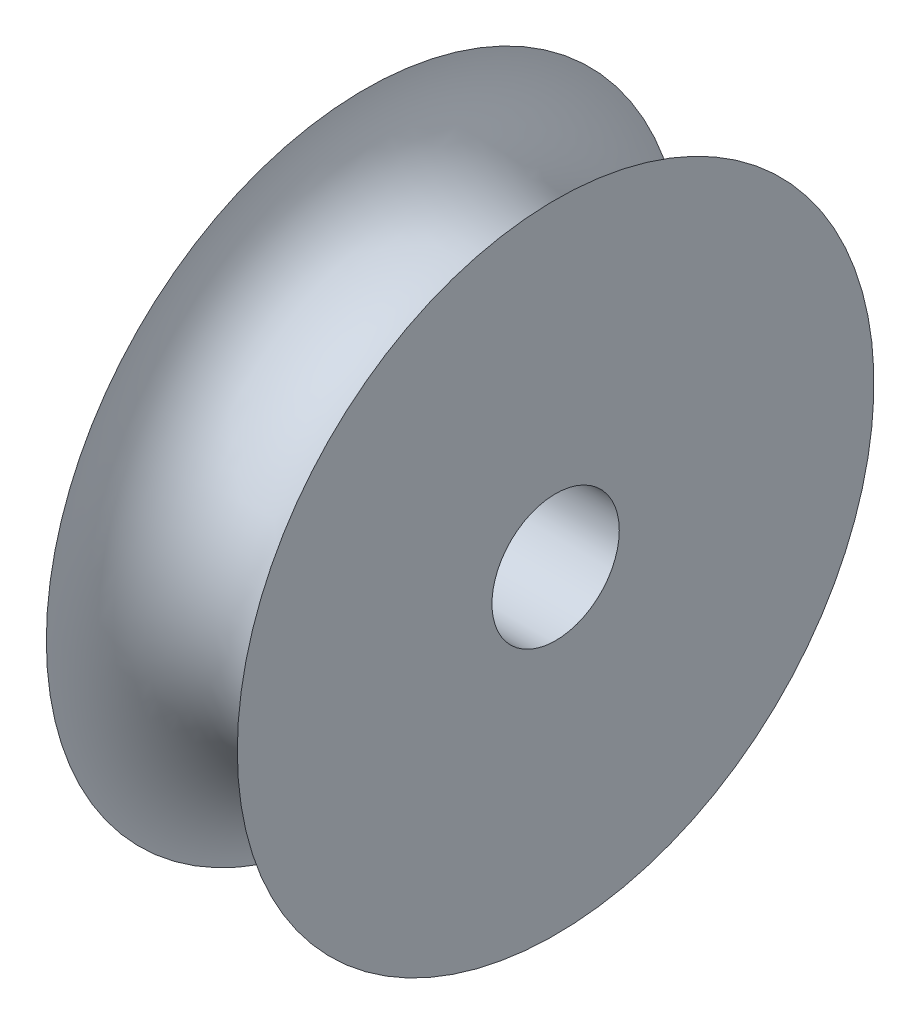
ISO-10303-21;
HEADER;
FILE_DESCRIPTION(('STEP AP214'),'2;1');
FILE_NAME('part.step','',(''),(''),'','','');
FILE_SCHEMA(('AUTOMOTIVE_DESIGN { 1 0 10303 214 1 1 1 1 }'));
ENDSEC;
DATA;
#1=APPLICATION_CONTEXT('core data for automotive mechanical design processes');
#2=APPLICATION_PROTOCOL_DEFINITION('international standard','automotive_design',2000,#1);
#3=PRODUCT_CONTEXT('',#1,'mechanical');
#4=PRODUCT('Part','Part','',(#3));
#5=PRODUCT_RELATED_PRODUCT_CATEGORY('part','',(#4));
#6=PRODUCT_DEFINITION_FORMATION('','',#4);
#7=PRODUCT_DEFINITION_CONTEXT('part definition',#1,'design');
#8=PRODUCT_DEFINITION('design','',#6,#7);
#9=PRODUCT_DEFINITION_SHAPE('','',#8);
#10=(LENGTH_UNIT() NAMED_UNIT(*) SI_UNIT(.MILLI.,.METRE.));
#11=(NAMED_UNIT(*) PLANE_ANGLE_UNIT() SI_UNIT($,.RADIAN.));
#12=(NAMED_UNIT(*) SI_UNIT($,.STERADIAN.) SOLID_ANGLE_UNIT());
#13=UNCERTAINTY_MEASURE_WITH_UNIT(LENGTH_MEASURE(1.E-05),#10,'distance_accuracy_value','');
#14=(GEOMETRIC_REPRESENTATION_CONTEXT(3) GLOBAL_UNCERTAINTY_ASSIGNED_CONTEXT((#13)) GLOBAL_UNIT_ASSIGNED_CONTEXT((#10,
#11,#12)) REPRESENTATION_CONTEXT('',''));
#15=CARTESIAN_POINT('',(0.,0.,0.));
#16=DIRECTION('',(0.,0.,1.));
#17=DIRECTION('',(1.,0.,0.));
#18=AXIS2_PLACEMENT_3D('',#15,#16,#17);
#19=CARTESIAN_POINT('',(4.7625,0.,0.));
#20=DIRECTION('',(-1.,0.,0.));
#21=DIRECTION('',(0.,0.,1.));
#22=AXIS2_PLACEMENT_3D('',#19,#20,#21);
#23=TOROIDAL_SURFACE('',#22,15.875,4.7625);
#24=CARTESIAN_POINT('',(0.,0.,0.));
#25=DIRECTION('',(-1.,0.,0.));
#26=DIRECTION('',(0.,0.,1.));
#27=AXIS2_PLACEMENT_3D('',#24,#25,#26);
#28=CIRCLE('',#27,15.875);
#29=CARTESIAN_POINT('',(0.,0.,15.875));
#30=VERTEX_POINT('',#29);
#31=EDGE_CURVE('E10',#30,#30,#28,.T.);
#32=ORIENTED_EDGE('',*,*,#31,.F.);
#33=EDGE_LOOP('',(#32));
#34=FACE_BOUND('',#33,.T.);
#35=CARTESIAN_POINT('',(9.525,0.,0.));
#36=DIRECTION('',(-1.,0.,0.));
#37=DIRECTION('',(0.,0.,1.));
#38=AXIS2_PLACEMENT_3D('',#35,#36,#37);
#39=CIRCLE('',#38,15.875);
#40=CARTESIAN_POINT('',(9.525,0.,15.875));
#41=VERTEX_POINT('',#40);
#42=EDGE_CURVE('E36',#41,#41,#39,.T.);
#43=ORIENTED_EDGE('',*,*,#42,.T.);
#44=EDGE_LOOP('',(#43));
#45=FACE_BOUND('',#44,.T.);
#46=ADVANCED_FACE('F30',(#34,#45),#23,.F.);
#47=CARTESIAN_POINT('',(0.,15.875,0.));
#48=DIRECTION('',(1.,0.,0.));
#49=DIRECTION('',(0.,0.,-1.));
#50=AXIS2_PLACEMENT_3D('',#47,#48,#49);
#51=PLANE('',#50);
#52=CARTESIAN_POINT('',(0.,0.,0.));
#53=DIRECTION('',(1.,0.,0.));
#54=DIRECTION('',(0.,0.,-1.));
#55=AXIS2_PLACEMENT_3D('',#52,#53,#54);
#56=CIRCLE('',#55,3.175);
#57=CARTESIAN_POINT('',(0.,0.,-3.175));
#58=VERTEX_POINT('',#57);
#59=EDGE_CURVE('E40',#58,#58,#56,.T.);
#60=ORIENTED_EDGE('',*,*,#59,.T.);
#61=EDGE_LOOP('',(#60));
#62=FACE_BOUND('',#61,.T.);
#63=ORIENTED_EDGE('',*,*,#31,.T.);
#64=EDGE_LOOP('',(#63));
#65=FACE_BOUND('',#64,.T.);
#66=ADVANCED_FACE('F55',(#62,#65),#51,.F.);
#67=CARTESIAN_POINT('',(9.525,0.,0.));
#68=DIRECTION('',(-1.,0.,0.));
#69=DIRECTION('',(0.,0.,1.));
#70=AXIS2_PLACEMENT_3D('',#67,#68,#69);
#71=PLANE('',#70);
#72=CARTESIAN_POINT('',(9.525,0.,0.));
#73=DIRECTION('',(1.,0.,0.));
#74=DIRECTION('',(0.,0.,-1.));
#75=AXIS2_PLACEMENT_3D('',#72,#73,#74);
#76=CIRCLE('',#75,3.175);
#77=CARTESIAN_POINT('',(9.525,0.,-3.175));
#78=VERTEX_POINT('',#77);
#79=EDGE_CURVE('E44',#78,#78,#76,.T.);
#80=ORIENTED_EDGE('',*,*,#79,.F.);
#81=EDGE_LOOP('',(#80));
#82=FACE_BOUND('',#81,.T.);
#83=ORIENTED_EDGE('',*,*,#42,.F.);
#84=EDGE_LOOP('',(#83));
#85=FACE_BOUND('',#84,.T.);
#86=ADVANCED_FACE('F52',(#82,#85),#71,.F.);
#87=CARTESIAN_POINT('',(0.,0.,0.));
#88=DIRECTION('',(1.,0.,0.));
#89=DIRECTION('',(0.,0.,-1.));
#90=AXIS2_PLACEMENT_3D('',#87,#88,#89);
#91=CYLINDRICAL_SURFACE('',#90,3.175);
#92=ORIENTED_EDGE('',*,*,#59,.F.);
#93=EDGE_LOOP('',(#92));
#94=FACE_BOUND('',#93,.T.);
#95=ORIENTED_EDGE('',*,*,#79,.T.);
#96=EDGE_LOOP('',(#95));
#97=FACE_BOUND('',#96,.T.);
#98=ADVANCED_FACE('F50',(#94,#97),#91,.F.);
#99=CLOSED_SHELL('',(#46,#66,#86,#98));
#100=MANIFOLD_SOLID_BREP('B2',#99);
#101=ADVANCED_BREP_SHAPE_REPRESENTATION('',(#18,#100),#14);
#102=SHAPE_DEFINITION_REPRESENTATION(#9,#101);
ENDSEC;
END-ISO-10303-21;
